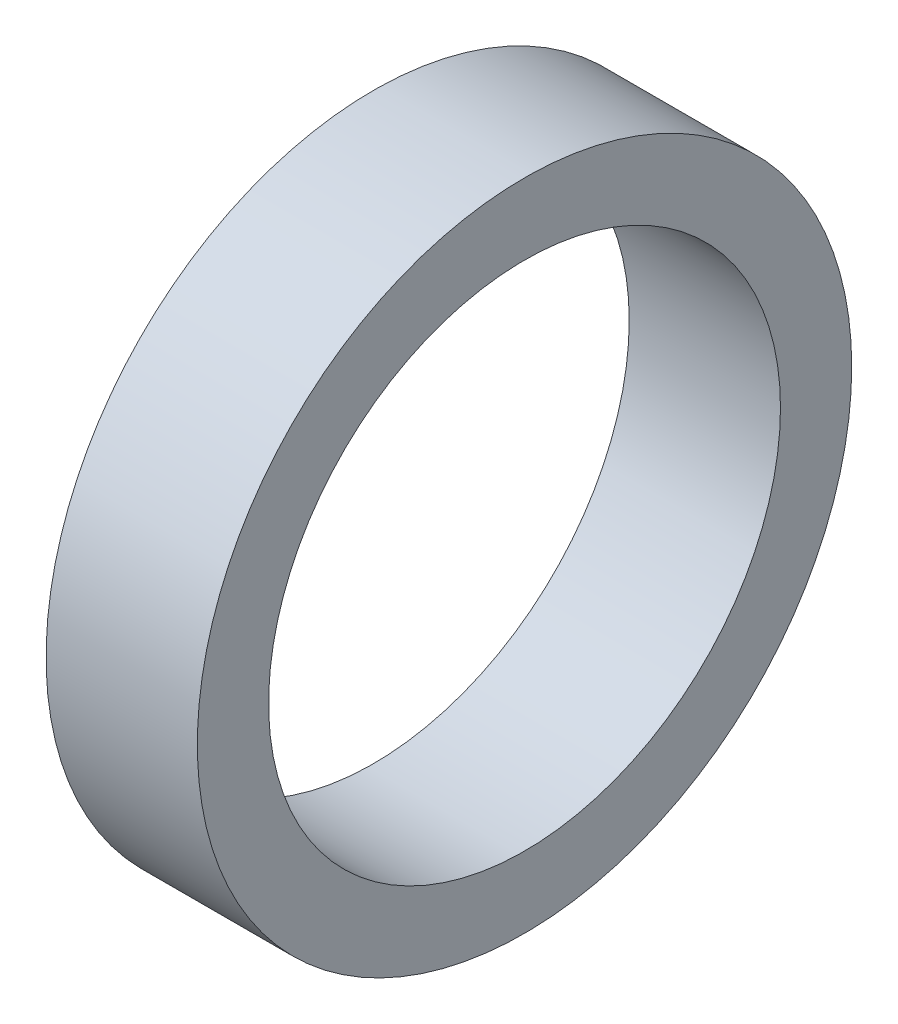
ISO-10303-21;
HEADER;
FILE_DESCRIPTION(('STEP AP214'),'2;1');
FILE_NAME('part.step','',(''),(''),'','','');
FILE_SCHEMA(('AUTOMOTIVE_DESIGN { 1 0 10303 214 1 1 1 1 }'));
ENDSEC;
DATA;
#1=APPLICATION_CONTEXT('core data for automotive mechanical design processes');
#2=APPLICATION_PROTOCOL_DEFINITION('international standard','automotive_design',2000,#1);
#3=PRODUCT_CONTEXT('',#1,'mechanical');
#4=PRODUCT('Part','Part','',(#3));
#5=PRODUCT_RELATED_PRODUCT_CATEGORY('part','',(#4));
#6=PRODUCT_DEFINITION_FORMATION('','',#4);
#7=PRODUCT_DEFINITION_CONTEXT('part definition',#1,'design');
#8=PRODUCT_DEFINITION('design','',#6,#7);
#9=PRODUCT_DEFINITION_SHAPE('','',#8);
#10=(LENGTH_UNIT() NAMED_UNIT(*) SI_UNIT(.MILLI.,.METRE.));
#11=(NAMED_UNIT(*) PLANE_ANGLE_UNIT() SI_UNIT($,.RADIAN.));
#12=(NAMED_UNIT(*) SI_UNIT($,.STERADIAN.) SOLID_ANGLE_UNIT());
#13=UNCERTAINTY_MEASURE_WITH_UNIT(LENGTH_MEASURE(1.E-05),#10,'distance_accuracy_value','');
#14=(GEOMETRIC_REPRESENTATION_CONTEXT(3) GLOBAL_UNCERTAINTY_ASSIGNED_CONTEXT((#13)) GLOBAL_UNIT_ASSIGNED_CONTEXT((#10,
#11,#12)) REPRESENTATION_CONTEXT('',''));
#15=CARTESIAN_POINT('',(0.,0.,0.));
#16=DIRECTION('',(0.,0.,1.));
#17=DIRECTION('',(1.,0.,0.));
#18=AXIS2_PLACEMENT_3D('',#15,#16,#17);
#19=CARTESIAN_POINT('',(6.604,0.,0.));
#20=DIRECTION('',(1.,0.,0.));
#21=DIRECTION('',(0.,0.,-1.));
#22=AXIS2_PLACEMENT_3D('',#19,#20,#21);
#23=PLANE('',#22);
#24=CARTESIAN_POINT('',(6.604,0.,0.));
#25=DIRECTION('',(1.,0.,0.));
#26=DIRECTION('',(0.,0.,-1.));
#27=AXIS2_PLACEMENT_3D('',#24,#25,#26);
#28=CIRCLE('',#27,14.2875);
#29=CARTESIAN_POINT('',(6.604,0.,-14.2875));
#30=VERTEX_POINT('',#29);
#31=EDGE_CURVE('E10',#30,#30,#28,.T.);
#32=ORIENTED_EDGE('',*,*,#31,.T.);
#33=EDGE_LOOP('',(#32));
#34=FACE_BOUND('',#33,.T.);
#35=CARTESIAN_POINT('',(6.604,0.,0.));
#36=DIRECTION('',(1.,0.,0.));
#37=DIRECTION('',(0.,0.,-1.));
#38=AXIS2_PLACEMENT_3D('',#35,#36,#37);
#39=CIRCLE('',#38,11.176);
#40=CARTESIAN_POINT('',(6.604,0.,-11.176));
#41=VERTEX_POINT('',#40);
#42=EDGE_CURVE('E50',#41,#41,#39,.T.);
#43=ORIENTED_EDGE('',*,*,#42,.F.);
#44=EDGE_LOOP('',(#43));
#45=FACE_BOUND('',#44,.T.);
#46=ADVANCED_FACE('F39',(#34,#45),#23,.T.);
#47=CARTESIAN_POINT('',(0.,0.,0.));
#48=DIRECTION('',(1.,0.,0.));
#49=DIRECTION('',(0.,0.,-1.));
#50=AXIS2_PLACEMENT_3D('',#47,#48,#49);
#51=PLANE('',#50);
#52=CARTESIAN_POINT('',(0.,0.,0.));
#53=DIRECTION('',(1.,0.,0.));
#54=DIRECTION('',(0.,0.,-1.));
#55=AXIS2_PLACEMENT_3D('',#52,#53,#54);
#56=CIRCLE('',#55,14.2875);
#57=CARTESIAN_POINT('',(0.,0.,-14.2875));
#58=VERTEX_POINT('',#57);
#59=EDGE_CURVE('E43',#58,#58,#56,.T.);
#60=ORIENTED_EDGE('',*,*,#59,.F.);
#61=EDGE_LOOP('',(#60));
#62=FACE_BOUND('',#61,.T.);
#63=CARTESIAN_POINT('',(0.,0.,0.));
#64=DIRECTION('',(1.,0.,0.));
#65=DIRECTION('',(0.,0.,-1.));
#66=AXIS2_PLACEMENT_3D('',#63,#64,#65);
#67=CIRCLE('',#66,11.176);
#68=CARTESIAN_POINT('',(0.,0.,-11.176));
#69=VERTEX_POINT('',#68);
#70=EDGE_CURVE('E52',#69,#69,#67,.T.);
#71=ORIENTED_EDGE('',*,*,#70,.T.);
#72=EDGE_LOOP('',(#71));
#73=FACE_BOUND('',#72,.T.);
#74=ADVANCED_FACE('F62',(#62,#73),#51,.F.);
#75=CARTESIAN_POINT('',(6.604,0.,0.));
#76=DIRECTION('',(-1.,0.,0.));
#77=DIRECTION('',(0.,0.,1.));
#78=AXIS2_PLACEMENT_3D('',#75,#76,#77);
#79=CYLINDRICAL_SURFACE('',#78,14.2875);
#80=ORIENTED_EDGE('',*,*,#31,.F.);
#81=EDGE_LOOP('',(#80));
#82=FACE_BOUND('',#81,.T.);
#83=ORIENTED_EDGE('',*,*,#59,.T.);
#84=EDGE_LOOP('',(#83));
#85=FACE_BOUND('',#84,.T.);
#86=ADVANCED_FACE('F41',(#82,#85),#79,.T.);
#87=CARTESIAN_POINT('',(6.604,0.,0.));
#88=DIRECTION('',(-1.,0.,0.));
#89=DIRECTION('',(0.,0.,1.));
#90=AXIS2_PLACEMENT_3D('',#87,#88,#89);
#91=CYLINDRICAL_SURFACE('',#90,11.176);
#92=ORIENTED_EDGE('',*,*,#42,.T.);
#93=EDGE_LOOP('',(#92));
#94=FACE_BOUND('',#93,.T.);
#95=ORIENTED_EDGE('',*,*,#70,.F.);
#96=EDGE_LOOP('',(#95));
#97=FACE_BOUND('',#96,.T.);
#98=ADVANCED_FACE('F58',(#94,#97),#91,.F.);
#99=CLOSED_SHELL('',(#46,#74,#86,#98));
#100=MANIFOLD_SOLID_BREP('B2',#99);
#101=ADVANCED_BREP_SHAPE_REPRESENTATION('',(#18,#100),#14);
#102=SHAPE_DEFINITION_REPRESENTATION(#9,#101);
ENDSEC;
END-ISO-10303-21;
